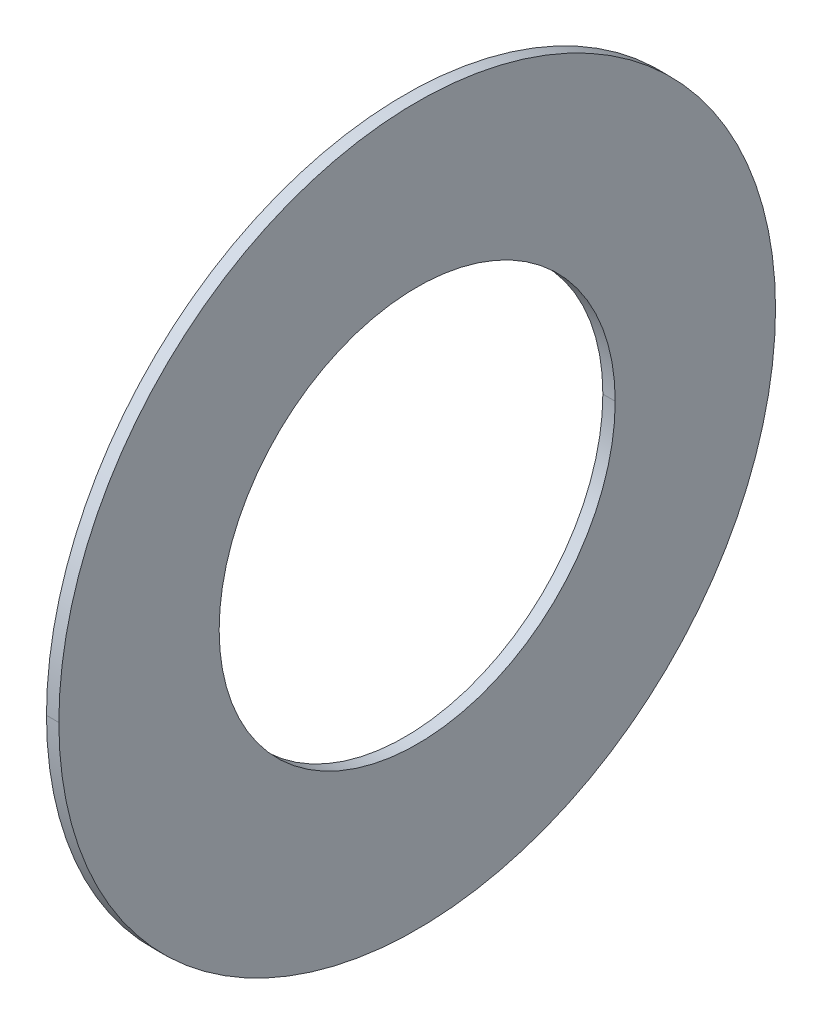
ISO-10303-21;
HEADER;
FILE_DESCRIPTION(('STEP AP214'),'2;1');
FILE_NAME('part.step','',(''),(''),'','','');
FILE_SCHEMA(('AUTOMOTIVE_DESIGN { 1 0 10303 214 1 1 1 1 }'));
ENDSEC;
DATA;
#1=APPLICATION_CONTEXT('core data for automotive mechanical design processes');
#2=APPLICATION_PROTOCOL_DEFINITION('international standard','automotive_design',2000,#1);
#3=PRODUCT_CONTEXT('',#1,'mechanical');
#4=PRODUCT('Part','Part','',(#3));
#5=PRODUCT_RELATED_PRODUCT_CATEGORY('part','',(#4));
#6=PRODUCT_DEFINITION_FORMATION('','',#4);
#7=PRODUCT_DEFINITION_CONTEXT('part definition',#1,'design');
#8=PRODUCT_DEFINITION('design','',#6,#7);
#9=PRODUCT_DEFINITION_SHAPE('','',#8);
#10=(LENGTH_UNIT() NAMED_UNIT(*) SI_UNIT(.MILLI.,.METRE.));
#11=(NAMED_UNIT(*) PLANE_ANGLE_UNIT() SI_UNIT($,.RADIAN.));
#12=(NAMED_UNIT(*) SI_UNIT($,.STERADIAN.) SOLID_ANGLE_UNIT());
#13=UNCERTAINTY_MEASURE_WITH_UNIT(LENGTH_MEASURE(1.E-05),#10,'distance_accuracy_value','');
#14=(GEOMETRIC_REPRESENTATION_CONTEXT(3) GLOBAL_UNCERTAINTY_ASSIGNED_CONTEXT((#13)) GLOBAL_UNIT_ASSIGNED_CONTEXT((#10,
#11,#12)) REPRESENTATION_CONTEXT('',''));
#15=CARTESIAN_POINT('',(0.,0.,0.));
#16=DIRECTION('',(0.,0.,1.));
#17=DIRECTION('',(1.,0.,0.));
#18=AXIS2_PLACEMENT_3D('',#15,#16,#17);
#19=CARTESIAN_POINT('',(0.4375,9.5,0.));
#20=DIRECTION('',(-1.,0.,0.));
#21=DIRECTION('',(0.,0.,1.));
#22=AXIS2_PLACEMENT_3D('',#19,#20,#21);
#23=PLANE('',#22);
#24=CARTESIAN_POINT('',(0.4375,0.,0.));
#25=DIRECTION('',(1.,0.,0.));
#26=DIRECTION('',(0.,0.,-1.));
#27=AXIS2_PLACEMENT_3D('',#24,#25,#26);
#28=CIRCLE('',#27,5.25);
#29=CARTESIAN_POINT('',(0.4375,0.,-5.25));
#30=VERTEX_POINT('',#29);
#31=CARTESIAN_POINT('',(0.4375,0.,5.25));
#32=VERTEX_POINT('',#31);
#33=EDGE_CURVE('E11',#30,#32,#28,.T.);
#34=ORIENTED_EDGE('',*,*,#33,.T.);
#35=CARTESIAN_POINT('',(0.4375,0.,0.));
#36=DIRECTION('',(1.,0.,0.));
#37=DIRECTION('',(0.,0.,-1.));
#38=AXIS2_PLACEMENT_3D('',#35,#36,#37);
#39=CIRCLE('',#38,5.25);
#40=EDGE_CURVE('E24',#32,#30,#39,.T.);
#41=ORIENTED_EDGE('',*,*,#40,.T.);
#42=EDGE_LOOP('',(#34,#41));
#43=FACE_BOUND('',#42,.T.);
#44=CARTESIAN_POINT('',(0.4375,0.,0.));
#45=DIRECTION('',(1.,0.,0.));
#46=DIRECTION('',(0.,0.,-1.));
#47=AXIS2_PLACEMENT_3D('',#44,#45,#46);
#48=CIRCLE('',#47,9.5);
#49=CARTESIAN_POINT('',(0.4375,0.,-9.5));
#50=VERTEX_POINT('',#49);
#51=CARTESIAN_POINT('',(0.4375,0.,9.5));
#52=VERTEX_POINT('',#51);
#53=EDGE_CURVE('E95',#50,#52,#48,.T.);
#54=ORIENTED_EDGE('',*,*,#53,.F.);
#55=CARTESIAN_POINT('',(0.4375,0.,0.));
#56=DIRECTION('',(1.,0.,0.));
#57=DIRECTION('',(0.,0.,-1.));
#58=AXIS2_PLACEMENT_3D('',#55,#56,#57);
#59=CIRCLE('',#58,9.5);
#60=EDGE_CURVE('E90',#52,#50,#59,.T.);
#61=ORIENTED_EDGE('',*,*,#60,.F.);
#62=EDGE_LOOP('',(#54,#61));
#63=FACE_BOUND('',#62,.T.);
#64=ADVANCED_FACE('F16',(#43,#63),#23,.T.);
#65=CARTESIAN_POINT('',(0.76545,0.,0.));
#66=DIRECTION('',(-1.,0.,0.));
#67=DIRECTION('',(0.,1.,0.));
#68=AXIS2_PLACEMENT_3D('',#65,#66,#67);
#69=CYLINDRICAL_SURFACE('',#68,9.5);
#70=ORIENTED_EDGE('',*,*,#60,.T.);
#71=DIRECTION('',(-1.,0.,0.));
#72=VECTOR('',#71,1.);
#73=CARTESIAN_POINT('',(0.76545,0.,-9.5));
#74=LINE('',#73,#72);
#75=CARTESIAN_POINT('',(0.76545,0.,-9.5));
#76=VERTEX_POINT('',#75);
#77=EDGE_CURVE('E85',#76,#50,#74,.T.);
#78=ORIENTED_EDGE('',*,*,#77,.F.);
#79=CARTESIAN_POINT('',(0.76545,0.,0.));
#80=DIRECTION('',(1.,0.,0.));
#81=DIRECTION('',(0.,0.,-1.));
#82=AXIS2_PLACEMENT_3D('',#79,#80,#81);
#83=CIRCLE('',#82,9.5);
#84=CARTESIAN_POINT('',(0.76545,0.,9.5));
#85=VERTEX_POINT('',#84);
#86=EDGE_CURVE('E80',#85,#76,#83,.T.);
#87=ORIENTED_EDGE('',*,*,#86,.F.);
#88=DIRECTION('',(-1.,0.,0.));
#89=VECTOR('',#88,1.);
#90=CARTESIAN_POINT('',(0.76545,0.,9.5));
#91=LINE('',#90,#89);
#92=EDGE_CURVE('E69',#85,#52,#91,.T.);
#93=ORIENTED_EDGE('',*,*,#92,.T.);
#94=EDGE_LOOP('',(#70,#78,#87,#93));
#95=FACE_BOUND('',#94,.T.);
#96=ADVANCED_FACE('F110',(#95),#69,.T.);
#97=CARTESIAN_POINT('',(0.76545,0.,0.));
#98=DIRECTION('',(-1.,0.,0.));
#99=DIRECTION('',(0.,-1.,0.));
#100=AXIS2_PLACEMENT_3D('',#97,#98,#99);
#101=CYLINDRICAL_SURFACE('',#100,9.5);
#102=CARTESIAN_POINT('',(0.76545,0.,0.));
#103=DIRECTION('',(1.,0.,0.));
#104=DIRECTION('',(0.,0.,-1.));
#105=AXIS2_PLACEMENT_3D('',#102,#103,#104);
#106=CIRCLE('',#105,9.5);
#107=EDGE_CURVE('E66',#76,#85,#106,.T.);
#108=ORIENTED_EDGE('',*,*,#107,.F.);
#109=ORIENTED_EDGE('',*,*,#77,.T.);
#110=ORIENTED_EDGE('',*,*,#53,.T.);
#111=ORIENTED_EDGE('',*,*,#92,.F.);
#112=EDGE_LOOP('',(#108,#109,#110,#111));
#113=FACE_BOUND('',#112,.T.);
#114=ADVANCED_FACE('F107',(#113),#101,.T.);
#115=CARTESIAN_POINT('',(0.76545,5.25,0.));
#116=DIRECTION('',(1.,0.,0.));
#117=DIRECTION('',(0.,0.,-1.));
#118=AXIS2_PLACEMENT_3D('',#115,#116,#117);
#119=PLANE('',#118);
#120=ORIENTED_EDGE('',*,*,#107,.T.);
#121=ORIENTED_EDGE('',*,*,#86,.T.);
#122=EDGE_LOOP('',(#120,#121));
#123=FACE_BOUND('',#122,.T.);
#124=CARTESIAN_POINT('',(0.76545,0.,0.));
#125=DIRECTION('',(1.,0.,0.));
#126=DIRECTION('',(0.,0.,-1.));
#127=AXIS2_PLACEMENT_3D('',#124,#125,#126);
#128=CIRCLE('',#127,5.25);
#129=CARTESIAN_POINT('',(0.76545,0.,-5.25));
#130=VERTEX_POINT('',#129);
#131=CARTESIAN_POINT('',(0.76545,0.,5.25));
#132=VERTEX_POINT('',#131);
#133=EDGE_CURVE('E55',#130,#132,#128,.T.);
#134=ORIENTED_EDGE('',*,*,#133,.F.);
#135=CARTESIAN_POINT('',(0.76545,0.,0.));
#136=DIRECTION('',(1.,0.,0.));
#137=DIRECTION('',(0.,0.,-1.));
#138=AXIS2_PLACEMENT_3D('',#135,#136,#137);
#139=CIRCLE('',#138,5.25);
#140=EDGE_CURVE('E51',#132,#130,#139,.T.);
#141=ORIENTED_EDGE('',*,*,#140,.F.);
#142=EDGE_LOOP('',(#134,#141));
#143=FACE_BOUND('',#142,.T.);
#144=ADVANCED_FACE('F53',(#123,#143),#119,.T.);
#145=CARTESIAN_POINT('',(0.76545,0.,0.));
#146=DIRECTION('',(-1.,0.,0.));
#147=DIRECTION('',(0.,1.,0.));
#148=AXIS2_PLACEMENT_3D('',#145,#146,#147);
#149=CYLINDRICAL_SURFACE('',#148,5.25);
#150=ORIENTED_EDGE('',*,*,#40,.F.);
#151=DIRECTION('',(-1.,0.,0.));
#152=VECTOR('',#151,1.);
#153=CARTESIAN_POINT('',(0.76545,0.,5.25));
#154=LINE('',#153,#152);
#155=EDGE_CURVE('E58',#132,#32,#154,.T.);
#156=ORIENTED_EDGE('',*,*,#155,.F.);
#157=ORIENTED_EDGE('',*,*,#140,.T.);
#158=DIRECTION('',(-1.,0.,0.));
#159=VECTOR('',#158,1.);
#160=CARTESIAN_POINT('',(0.76545,0.,-5.25));
#161=LINE('',#160,#159);
#162=EDGE_CURVE('E63',#130,#30,#161,.T.);
#163=ORIENTED_EDGE('',*,*,#162,.T.);
#164=EDGE_LOOP('',(#150,#156,#157,#163));
#165=FACE_BOUND('',#164,.T.);
#166=ADVANCED_FACE('F61',(#165),#149,.F.);
#167=CARTESIAN_POINT('',(0.76545,0.,0.));
#168=DIRECTION('',(-1.,0.,0.));
#169=DIRECTION('',(0.,-1.,0.));
#170=AXIS2_PLACEMENT_3D('',#167,#168,#169);
#171=CYLINDRICAL_SURFACE('',#170,5.25);
#172=ORIENTED_EDGE('',*,*,#133,.T.);
#173=ORIENTED_EDGE('',*,*,#155,.T.);
#174=ORIENTED_EDGE('',*,*,#33,.F.);
#175=ORIENTED_EDGE('',*,*,#162,.F.);
#176=EDGE_LOOP('',(#172,#173,#174,#175));
#177=FACE_BOUND('',#176,.T.);
#178=ADVANCED_FACE('F65',(#177),#171,.F.);
#179=CLOSED_SHELL('',(#64,#96,#114,#144,#166,#178));
#180=MANIFOLD_SOLID_BREP('B1',#179);
#181=ADVANCED_BREP_SHAPE_REPRESENTATION('',(#18,#180),#14);
#182=SHAPE_DEFINITION_REPRESENTATION(#9,#181);
ENDSEC;
END-ISO-10303-21;
